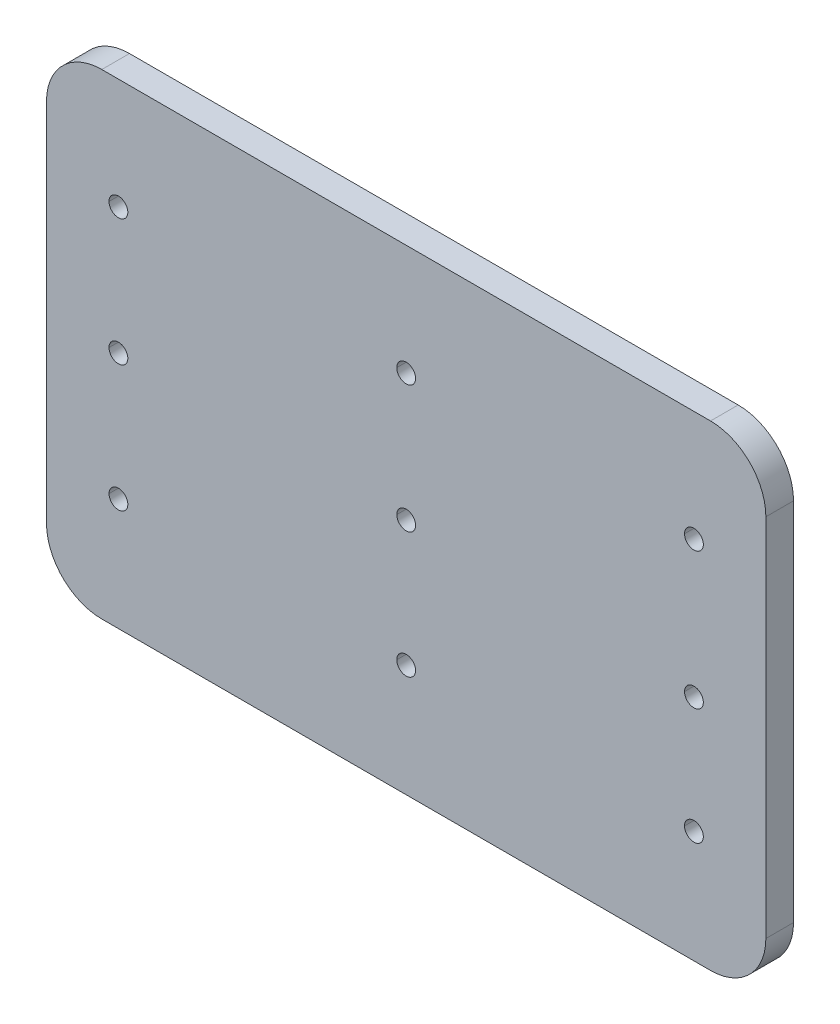
ISO-10303-21;
HEADER;
FILE_DESCRIPTION(('STEP AP214'),'2;1');
FILE_NAME('part.step','',(''),(''),'','','');
FILE_SCHEMA(('AUTOMOTIVE_DESIGN { 1 0 10303 214 1 1 1 1 }'));
ENDSEC;
DATA;
#1=APPLICATION_CONTEXT('core data for automotive mechanical design processes');
#2=APPLICATION_PROTOCOL_DEFINITION('international standard','automotive_design',2000,#1);
#3=PRODUCT_CONTEXT('',#1,'mechanical');
#4=PRODUCT('Part','Part','',(#3));
#5=PRODUCT_RELATED_PRODUCT_CATEGORY('part','',(#4));
#6=PRODUCT_DEFINITION_FORMATION('','',#4);
#7=PRODUCT_DEFINITION_CONTEXT('part definition',#1,'design');
#8=PRODUCT_DEFINITION('design','',#6,#7);
#9=PRODUCT_DEFINITION_SHAPE('','',#8);
#10=(LENGTH_UNIT() NAMED_UNIT(*) SI_UNIT(.MILLI.,.METRE.));
#11=(NAMED_UNIT(*) PLANE_ANGLE_UNIT() SI_UNIT($,.RADIAN.));
#12=(NAMED_UNIT(*) SI_UNIT($,.STERADIAN.) SOLID_ANGLE_UNIT());
#13=UNCERTAINTY_MEASURE_WITH_UNIT(LENGTH_MEASURE(1.E-05),#10,'distance_accuracy_value','');
#14=(GEOMETRIC_REPRESENTATION_CONTEXT(3) GLOBAL_UNCERTAINTY_ASSIGNED_CONTEXT((#13)) GLOBAL_UNIT_ASSIGNED_CONTEXT((#10,
#11,#12)) REPRESENTATION_CONTEXT('',''));
#15=CARTESIAN_POINT('',(0.,0.,0.));
#16=DIRECTION('',(0.,0.,1.));
#17=DIRECTION('',(1.,0.,0.));
#18=AXIS2_PLACEMENT_3D('',#15,#16,#17);
#19=CARTESIAN_POINT('',(116.318744279938,128.56204329235,170.581582908599));
#20=DIRECTION('',(0.,0.,-1.));
#21=DIRECTION('',(-1.,0.,0.));
#22=AXIS2_PLACEMENT_3D('',#19,#20,#21);
#23=CYLINDRICAL_SURFACE('',#22,1.7);
#24=CARTESIAN_POINT('',(116.318744279938,128.56204329235,170.581582908599));
#25=DIRECTION('',(0.,0.,1.));
#26=DIRECTION('',(1.,0.,0.));
#27=AXIS2_PLACEMENT_3D('',#24,#25,#26);
#28=CIRCLE('',#27,1.7);
#29=CARTESIAN_POINT('',(114.618744279938,128.56204329235,170.581582908599));
#30=VERTEX_POINT('',#29);
#31=CARTESIAN_POINT('',(118.018744279938,128.56204329235,170.581582908599));
#32=VERTEX_POINT('',#31);
#33=EDGE_CURVE('E11',#30,#32,#28,.T.);
#34=ORIENTED_EDGE('',*,*,#33,.T.);
#35=DIRECTION('',(0.,0.,-1.));
#36=VECTOR('',#35,1.);
#37=CARTESIAN_POINT('',(118.018744279938,128.56204329235,170.581582908599));
#38=LINE('',#37,#36);
#39=CARTESIAN_POINT('',(118.018744279938,128.56204329235,165.581582908599));
#40=VERTEX_POINT('',#39);
#41=EDGE_CURVE('E55',#32,#40,#38,.T.);
#42=ORIENTED_EDGE('',*,*,#41,.T.);
#43=CARTESIAN_POINT('',(116.318744279938,128.56204329235,165.581582908599));
#44=DIRECTION('',(0.,0.,1.));
#45=DIRECTION('',(1.,0.,0.));
#46=AXIS2_PLACEMENT_3D('',#43,#44,#45);
#47=CIRCLE('',#46,1.7);
#48=CARTESIAN_POINT('',(114.618744279938,128.56204329235,165.581582908599));
#49=VERTEX_POINT('',#48);
#50=EDGE_CURVE('E256',#49,#40,#47,.T.);
#51=ORIENTED_EDGE('',*,*,#50,.F.);
#52=DIRECTION('',(0.,0.,-1.));
#53=VECTOR('',#52,1.);
#54=CARTESIAN_POINT('',(114.618744279938,128.56204329235,170.581582908599));
#55=LINE('',#54,#53);
#56=EDGE_CURVE('E263',#30,#49,#55,.T.);
#57=ORIENTED_EDGE('',*,*,#56,.F.);
#58=EDGE_LOOP('',(#34,#42,#51,#57));
#59=FACE_BOUND('',#58,.T.);
#60=ADVANCED_FACE('F44',(#59),#23,.F.);
#61=CARTESIAN_POINT('',(220.318744279938,103.86204329235,170.581582908599));
#62=DIRECTION('',(0.,0.,-1.));
#63=DIRECTION('',(-1.,0.,0.));
#64=AXIS2_PLACEMENT_3D('',#61,#62,#63);
#65=CYLINDRICAL_SURFACE('',#64,1.7);
#66=CARTESIAN_POINT('',(220.318744279938,103.86204329235,170.581582908599));
#67=DIRECTION('',(0.,0.,1.));
#68=DIRECTION('',(1.,0.,0.));
#69=AXIS2_PLACEMENT_3D('',#66,#67,#68);
#70=CIRCLE('',#69,1.7);
#71=CARTESIAN_POINT('',(218.618744279938,103.86204329235,170.581582908599));
#72=VERTEX_POINT('',#71);
#73=CARTESIAN_POINT('',(222.018744279938,103.86204329235,170.581582908599));
#74=VERTEX_POINT('',#73);
#75=EDGE_CURVE('E322',#72,#74,#70,.T.);
#76=ORIENTED_EDGE('',*,*,#75,.T.);
#77=DIRECTION('',(0.,0.,-1.));
#78=VECTOR('',#77,1.);
#79=CARTESIAN_POINT('',(222.018744279938,103.86204329235,170.581582908599));
#80=LINE('',#79,#78);
#81=CARTESIAN_POINT('',(222.018744279938,103.86204329235,165.581582908599));
#82=VERTEX_POINT('',#81);
#83=EDGE_CURVE('E326',#74,#82,#80,.T.);
#84=ORIENTED_EDGE('',*,*,#83,.T.);
#85=CARTESIAN_POINT('',(220.318744279938,103.86204329235,165.581582908599));
#86=DIRECTION('',(0.,0.,1.));
#87=DIRECTION('',(1.,0.,0.));
#88=AXIS2_PLACEMENT_3D('',#85,#86,#87);
#89=CIRCLE('',#88,1.7);
#90=CARTESIAN_POINT('',(218.618744279938,103.86204329235,165.581582908599));
#91=VERTEX_POINT('',#90);
#92=EDGE_CURVE('E304',#91,#82,#89,.T.);
#93=ORIENTED_EDGE('',*,*,#92,.F.);
#94=DIRECTION('',(0.,0.,-1.));
#95=VECTOR('',#94,1.);
#96=CARTESIAN_POINT('',(218.618744279938,103.86204329235,170.581582908599));
#97=LINE('',#96,#95);
#98=EDGE_CURVE('E371',#72,#91,#97,.T.);
#99=ORIENTED_EDGE('',*,*,#98,.F.);
#100=EDGE_LOOP('',(#76,#84,#93,#99));
#101=FACE_BOUND('',#100,.T.);
#102=ADVANCED_FACE('F593',(#101),#65,.F.);
#103=CARTESIAN_POINT('',(168.318744279938,128.56204329235,170.581582908599));
#104=DIRECTION('',(0.,0.,-1.));
#105=DIRECTION('',(-1.,0.,0.));
#106=AXIS2_PLACEMENT_3D('',#103,#104,#105);
#107=CYLINDRICAL_SURFACE('',#106,1.7);
#108=CARTESIAN_POINT('',(168.318744279938,128.56204329235,170.581582908599));
#109=DIRECTION('',(0.,0.,1.));
#110=DIRECTION('',(1.,0.,0.));
#111=AXIS2_PLACEMENT_3D('',#108,#109,#110);
#112=CIRCLE('',#111,1.7);
#113=CARTESIAN_POINT('',(166.618744279938,128.56204329235,170.581582908599));
#114=VERTEX_POINT('',#113);
#115=CARTESIAN_POINT('',(170.018744279938,128.56204329235,170.581582908599));
#116=VERTEX_POINT('',#115);
#117=EDGE_CURVE('E452',#114,#116,#112,.T.);
#118=ORIENTED_EDGE('',*,*,#117,.T.);
#119=DIRECTION('',(0.,0.,-1.));
#120=VECTOR('',#119,1.);
#121=CARTESIAN_POINT('',(170.018744279938,128.56204329235,170.581582908599));
#122=LINE('',#121,#120);
#123=CARTESIAN_POINT('',(170.018744279938,128.56204329235,165.581582908599));
#124=VERTEX_POINT('',#123);
#125=EDGE_CURVE('E398',#116,#124,#122,.T.);
#126=ORIENTED_EDGE('',*,*,#125,.T.);
#127=CARTESIAN_POINT('',(168.318744279938,128.56204329235,165.581582908599));
#128=DIRECTION('',(0.,0.,1.));
#129=DIRECTION('',(1.,0.,0.));
#130=AXIS2_PLACEMENT_3D('',#127,#128,#129);
#131=CIRCLE('',#130,1.7);
#132=CARTESIAN_POINT('',(166.618744279938,128.56204329235,165.581582908599));
#133=VERTEX_POINT('',#132);
#134=EDGE_CURVE('E479',#133,#124,#131,.T.);
#135=ORIENTED_EDGE('',*,*,#134,.F.);
#136=DIRECTION('',(0.,0.,-1.));
#137=VECTOR('',#136,1.);
#138=CARTESIAN_POINT('',(166.618744279938,128.56204329235,170.581582908599));
#139=LINE('',#138,#137);
#140=EDGE_CURVE('E448',#114,#133,#139,.T.);
#141=ORIENTED_EDGE('',*,*,#140,.F.);
#142=EDGE_LOOP('',(#118,#126,#135,#141));
#143=FACE_BOUND('',#142,.T.);
#144=ADVANCED_FACE('F598',(#143),#107,.F.);
#145=CARTESIAN_POINT('',(168.318744279938,82.84204329235,170.581582908599));
#146=DIRECTION('',(0.,0.,-1.));
#147=DIRECTION('',(-1.,0.,0.));
#148=AXIS2_PLACEMENT_3D('',#145,#146,#147);
#149=CYLINDRICAL_SURFACE('',#148,1.7);
#150=CARTESIAN_POINT('',(168.318744279938,82.84204329235,170.581582908599));
#151=DIRECTION('',(0.,0.,1.));
#152=DIRECTION('',(1.,0.,0.));
#153=AXIS2_PLACEMENT_3D('',#150,#151,#152);
#154=CIRCLE('',#153,1.7);
#155=CARTESIAN_POINT('',(166.618744279938,82.84204329235,170.581582908599));
#156=VERTEX_POINT('',#155);
#157=CARTESIAN_POINT('',(170.018744279938,82.84204329235,170.581582908599));
#158=VERTEX_POINT('',#157);
#159=EDGE_CURVE('E394',#156,#158,#154,.T.);
#160=ORIENTED_EDGE('',*,*,#159,.T.);
#161=DIRECTION('',(0.,0.,-1.));
#162=VECTOR('',#161,1.);
#163=CARTESIAN_POINT('',(170.018744279938,82.84204329235,170.581582908599));
#164=LINE('',#163,#162);
#165=CARTESIAN_POINT('',(170.018744279938,82.84204329235,165.581582908599));
#166=VERTEX_POINT('',#165);
#167=EDGE_CURVE('E399',#158,#166,#164,.T.);
#168=ORIENTED_EDGE('',*,*,#167,.T.);
#169=CARTESIAN_POINT('',(168.318744279938,82.84204329235,165.581582908599));
#170=DIRECTION('',(0.,0.,1.));
#171=DIRECTION('',(1.,0.,0.));
#172=AXIS2_PLACEMENT_3D('',#169,#170,#171);
#173=CIRCLE('',#172,1.7);
#174=CARTESIAN_POINT('',(166.618744279938,82.84204329235,165.581582908599));
#175=VERTEX_POINT('',#174);
#176=EDGE_CURVE('E327',#175,#166,#173,.T.);
#177=ORIENTED_EDGE('',*,*,#176,.F.);
#178=DIRECTION('',(0.,0.,-1.));
#179=VECTOR('',#178,1.);
#180=CARTESIAN_POINT('',(166.618744279938,82.84204329235,170.581582908599));
#181=LINE('',#180,#179);
#182=EDGE_CURVE('E484',#156,#175,#181,.T.);
#183=ORIENTED_EDGE('',*,*,#182,.F.);
#184=EDGE_LOOP('',(#160,#168,#177,#183));
#185=FACE_BOUND('',#184,.T.);
#186=ADVANCED_FACE('F603',(#185),#149,.F.);
#187=CARTESIAN_POINT('',(168.318744279938,105.56204329235,170.581582908599));
#188=DIRECTION('',(0.,0.,-1.));
#189=DIRECTION('',(-1.,0.,0.));
#190=AXIS2_PLACEMENT_3D('',#187,#188,#189);
#191=CYLINDRICAL_SURFACE('',#190,1.7);
#192=CARTESIAN_POINT('',(168.318744279938,105.56204329235,170.581582908599));
#193=DIRECTION('',(0.,0.,1.));
#194=DIRECTION('',(1.,0.,0.));
#195=AXIS2_PLACEMENT_3D('',#192,#193,#194);
#196=CIRCLE('',#195,1.7);
#197=CARTESIAN_POINT('',(166.618744279938,105.56204329235,170.581582908599));
#198=VERTEX_POINT('',#197);
#199=CARTESIAN_POINT('',(170.018744279938,105.56204329235,170.581582908599));
#200=VERTEX_POINT('',#199);
#201=EDGE_CURVE('E340',#198,#200,#196,.T.);
#202=ORIENTED_EDGE('',*,*,#201,.T.);
#203=DIRECTION('',(0.,0.,-1.));
#204=VECTOR('',#203,1.);
#205=CARTESIAN_POINT('',(170.018744279938,105.56204329235,170.581582908599));
#206=LINE('',#205,#204);
#207=CARTESIAN_POINT('',(170.018744279938,105.56204329235,165.581582908599));
#208=VERTEX_POINT('',#207);
#209=EDGE_CURVE('E336',#200,#208,#206,.T.);
#210=ORIENTED_EDGE('',*,*,#209,.T.);
#211=CARTESIAN_POINT('',(168.318744279938,105.56204329235,165.581582908599));
#212=DIRECTION('',(0.,0.,1.));
#213=DIRECTION('',(1.,0.,0.));
#214=AXIS2_PLACEMENT_3D('',#211,#212,#213);
#215=CIRCLE('',#214,1.7);
#216=CARTESIAN_POINT('',(166.618744279938,105.56204329235,165.581582908599));
#217=VERTEX_POINT('',#216);
#218=EDGE_CURVE('E372',#217,#208,#215,.T.);
#219=ORIENTED_EDGE('',*,*,#218,.F.);
#220=DIRECTION('',(0.,0.,-1.));
#221=VECTOR('',#220,1.);
#222=CARTESIAN_POINT('',(166.618744279938,105.56204329235,170.581582908599));
#223=LINE('',#222,#221);
#224=EDGE_CURVE('E459',#198,#217,#223,.T.);
#225=ORIENTED_EDGE('',*,*,#224,.F.);
#226=EDGE_LOOP('',(#202,#210,#219,#225));
#227=FACE_BOUND('',#226,.T.);
#228=ADVANCED_FACE('F743',(#227),#191,.F.);
#229=CARTESIAN_POINT('',(116.318744279938,105.70204329235,170.581582908599));
#230=DIRECTION('',(0.,0.,-1.));
#231=DIRECTION('',(-1.,0.,0.));
#232=AXIS2_PLACEMENT_3D('',#229,#230,#231);
#233=CYLINDRICAL_SURFACE('',#232,1.7);
#234=CARTESIAN_POINT('',(116.318744279938,105.70204329235,170.581582908599));
#235=DIRECTION('',(0.,0.,1.));
#236=DIRECTION('',(1.,0.,0.));
#237=AXIS2_PLACEMENT_3D('',#234,#235,#236);
#238=CIRCLE('',#237,1.7);
#239=CARTESIAN_POINT('',(114.618744279938,105.70204329235,170.581582908599));
#240=VERTEX_POINT('',#239);
#241=CARTESIAN_POINT('',(118.018744279938,105.70204329235,170.581582908599));
#242=VERTEX_POINT('',#241);
#243=EDGE_CURVE('E286',#240,#242,#238,.T.);
#244=ORIENTED_EDGE('',*,*,#243,.T.);
#245=DIRECTION('',(0.,0.,-1.));
#246=VECTOR('',#245,1.);
#247=CARTESIAN_POINT('',(118.018744279938,105.70204329235,170.581582908599));
#248=LINE('',#247,#246);
#249=CARTESIAN_POINT('',(118.018744279938,105.70204329235,165.581582908599));
#250=VERTEX_POINT('',#249);
#251=EDGE_CURVE('E283',#242,#250,#248,.T.);
#252=ORIENTED_EDGE('',*,*,#251,.T.);
#253=CARTESIAN_POINT('',(116.318744279938,105.70204329235,165.581582908599));
#254=DIRECTION('',(0.,0.,1.));
#255=DIRECTION('',(1.,0.,0.));
#256=AXIS2_PLACEMENT_3D('',#253,#254,#255);
#257=CIRCLE('',#256,1.7);
#258=CARTESIAN_POINT('',(114.618744279938,105.70204329235,165.581582908599));
#259=VERTEX_POINT('',#258);
#260=EDGE_CURVE('E271',#259,#250,#257,.T.);
#261=ORIENTED_EDGE('',*,*,#260,.F.);
#262=DIRECTION('',(0.,0.,-1.));
#263=VECTOR('',#262,1.);
#264=CARTESIAN_POINT('',(114.618744279938,105.70204329235,170.581582908599));
#265=LINE('',#264,#263);
#266=EDGE_CURVE('E294',#240,#259,#265,.T.);
#267=ORIENTED_EDGE('',*,*,#266,.F.);
#268=EDGE_LOOP('',(#244,#252,#261,#267));
#269=FACE_BOUND('',#268,.T.);
#270=ADVANCED_FACE('F284',(#269),#233,.F.);
#271=CARTESIAN_POINT('',(220.318744279938,82.84204329235,170.581582908599));
#272=DIRECTION('',(0.,0.,-1.));
#273=DIRECTION('',(-1.,0.,0.));
#274=AXIS2_PLACEMENT_3D('',#271,#272,#273);
#275=CYLINDRICAL_SURFACE('',#274,1.7);
#276=CARTESIAN_POINT('',(220.318744279938,82.84204329235,170.581582908599));
#277=DIRECTION('',(0.,0.,1.));
#278=DIRECTION('',(1.,0.,0.));
#279=AXIS2_PLACEMENT_3D('',#276,#277,#278);
#280=CIRCLE('',#279,1.7);
#281=CARTESIAN_POINT('',(218.618744279938,82.84204329235,170.581582908599));
#282=VERTEX_POINT('',#281);
#283=CARTESIAN_POINT('',(222.018744279938,82.84204329235,170.581582908599));
#284=VERTEX_POINT('',#283);
#285=EDGE_CURVE('E291',#282,#284,#280,.T.);
#286=ORIENTED_EDGE('',*,*,#285,.T.);
#287=DIRECTION('',(0.,0.,-1.));
#288=VECTOR('',#287,1.);
#289=CARTESIAN_POINT('',(222.018744279938,82.84204329235,170.581582908599));
#290=LINE('',#289,#288);
#291=CARTESIAN_POINT('',(222.018744279938,82.84204329235,165.581582908599));
#292=VERTEX_POINT('',#291);
#293=EDGE_CURVE('E432',#284,#292,#290,.T.);
#294=ORIENTED_EDGE('',*,*,#293,.T.);
#295=CARTESIAN_POINT('',(220.318744279938,82.84204329235,165.581582908599));
#296=DIRECTION('',(0.,0.,1.));
#297=DIRECTION('',(1.,0.,0.));
#298=AXIS2_PLACEMENT_3D('',#295,#296,#297);
#299=CIRCLE('',#298,1.7);
#300=CARTESIAN_POINT('',(218.618744279938,82.84204329235,165.581582908599));
#301=VERTEX_POINT('',#300);
#302=EDGE_CURVE('E296',#301,#292,#299,.T.);
#303=ORIENTED_EDGE('',*,*,#302,.F.);
#304=DIRECTION('',(0.,0.,-1.));
#305=VECTOR('',#304,1.);
#306=CARTESIAN_POINT('',(218.618744279938,82.84204329235,170.581582908599));
#307=LINE('',#306,#305);
#308=EDGE_CURVE('E321',#282,#301,#307,.T.);
#309=ORIENTED_EDGE('',*,*,#308,.F.);
#310=EDGE_LOOP('',(#286,#294,#303,#309));
#311=FACE_BOUND('',#310,.T.);
#312=ADVANCED_FACE('F609',(#311),#275,.F.);
#313=CARTESIAN_POINT('',(220.318744279938,128.56204329235,170.581582908599));
#314=DIRECTION('',(0.,0.,-1.));
#315=DIRECTION('',(-1.,0.,0.));
#316=AXIS2_PLACEMENT_3D('',#313,#314,#315);
#317=CYLINDRICAL_SURFACE('',#316,1.7);
#318=CARTESIAN_POINT('',(220.318744279938,128.56204329235,170.581582908599));
#319=DIRECTION('',(0.,0.,1.));
#320=DIRECTION('',(1.,0.,0.));
#321=AXIS2_PLACEMENT_3D('',#318,#319,#320);
#322=CIRCLE('',#321,1.7);
#323=CARTESIAN_POINT('',(218.618744279938,128.56204329235,170.581582908599));
#324=VERTEX_POINT('',#323);
#325=CARTESIAN_POINT('',(222.018744279938,128.56204329235,170.581582908599));
#326=VERTEX_POINT('',#325);
#327=EDGE_CURVE('E428',#324,#326,#322,.T.);
#328=ORIENTED_EDGE('',*,*,#327,.T.);
#329=DIRECTION('',(0.,0.,-1.));
#330=VECTOR('',#329,1.);
#331=CARTESIAN_POINT('',(222.018744279938,128.56204329235,170.581582908599));
#332=LINE('',#331,#330);
#333=CARTESIAN_POINT('',(222.018744279938,128.56204329235,165.581582908599));
#334=VERTEX_POINT('',#333);
#335=EDGE_CURVE('E433',#326,#334,#332,.T.);
#336=ORIENTED_EDGE('',*,*,#335,.T.);
#337=CARTESIAN_POINT('',(220.318744279938,128.56204329235,165.581582908599));
#338=DIRECTION('',(0.,0.,1.));
#339=DIRECTION('',(1.,0.,0.));
#340=AXIS2_PLACEMENT_3D('',#337,#338,#339);
#341=CIRCLE('',#340,1.7);
#342=CARTESIAN_POINT('',(218.618744279938,128.56204329235,165.581582908599));
#343=VERTEX_POINT('',#342);
#344=EDGE_CURVE('E437',#343,#334,#341,.T.);
#345=ORIENTED_EDGE('',*,*,#344,.F.);
#346=DIRECTION('',(0.,0.,-1.));
#347=VECTOR('',#346,1.);
#348=CARTESIAN_POINT('',(218.618744279938,128.56204329235,170.581582908599));
#349=LINE('',#348,#347);
#350=EDGE_CURVE('E307',#324,#343,#349,.T.);
#351=ORIENTED_EDGE('',*,*,#350,.F.);
#352=EDGE_LOOP('',(#328,#336,#345,#351));
#353=FACE_BOUND('',#352,.T.);
#354=ADVANCED_FACE('F607',(#353),#317,.F.);
#355=CARTESIAN_POINT('',(116.318744279938,82.84204329235,170.581582908599));
#356=DIRECTION('',(0.,0.,-1.));
#357=DIRECTION('',(-1.,0.,0.));
#358=AXIS2_PLACEMENT_3D('',#355,#356,#357);
#359=CYLINDRICAL_SURFACE('',#358,1.7);
#360=CARTESIAN_POINT('',(116.318744279938,82.84204329235,170.581582908599));
#361=DIRECTION('',(0.,0.,1.));
#362=DIRECTION('',(1.,0.,0.));
#363=AXIS2_PLACEMENT_3D('',#360,#361,#362);
#364=CIRCLE('',#363,1.7);
#365=CARTESIAN_POINT('',(114.618744279938,82.84204329235,170.581582908599));
#366=VERTEX_POINT('',#365);
#367=CARTESIAN_POINT('',(118.018744279938,82.84204329235,170.581582908599));
#368=VERTEX_POINT('',#367);
#369=EDGE_CURVE('E494',#366,#368,#364,.T.);
#370=ORIENTED_EDGE('',*,*,#369,.T.);
#371=DIRECTION('',(0.,0.,-1.));
#372=VECTOR('',#371,1.);
#373=CARTESIAN_POINT('',(118.018744279938,82.84204329235,170.581582908599));
#374=LINE('',#373,#372);
#375=CARTESIAN_POINT('',(118.018744279938,82.84204329235,165.581582908599));
#376=VERTEX_POINT('',#375);
#377=EDGE_CURVE('E498',#368,#376,#374,.T.);
#378=ORIENTED_EDGE('',*,*,#377,.T.);
#379=CARTESIAN_POINT('',(116.318744279938,82.84204329235,165.581582908599));
#380=DIRECTION('',(0.,0.,1.));
#381=DIRECTION('',(1.,0.,0.));
#382=AXIS2_PLACEMENT_3D('',#379,#380,#381);
#383=CIRCLE('',#382,1.7);
#384=CARTESIAN_POINT('',(114.618744279938,82.84204329235,165.581582908599));
#385=VERTEX_POINT('',#384);
#386=EDGE_CURVE('E351',#385,#376,#383,.T.);
#387=ORIENTED_EDGE('',*,*,#386,.F.);
#388=DIRECTION('',(0.,0.,-1.));
#389=VECTOR('',#388,1.);
#390=CARTESIAN_POINT('',(114.618744279938,82.84204329235,170.581582908599));
#391=LINE('',#390,#389);
#392=EDGE_CURVE('E352',#366,#385,#391,.T.);
#393=ORIENTED_EDGE('',*,*,#392,.F.);
#394=EDGE_LOOP('',(#370,#378,#387,#393));
#395=FACE_BOUND('',#394,.T.);
#396=ADVANCED_FACE('F576',(#395),#359,.F.);
#397=CARTESIAN_POINT('',(113.318744279938,138.56204329235,170.581582908599));
#398=DIRECTION('',(0.,0.,-1.));
#399=DIRECTION('',(-1.,0.,0.));
#400=AXIS2_PLACEMENT_3D('',#397,#398,#399);
#401=CYLINDRICAL_SURFACE('',#400,10.);
#402=CARTESIAN_POINT('',(113.318744279938,138.56204329235,165.581582908599));
#403=DIRECTION('',(0.,0.,-1.));
#404=DIRECTION('',(1.,0.,0.));
#405=AXIS2_PLACEMENT_3D('',#402,#403,#404);
#406=CIRCLE('',#405,10.);
#407=CARTESIAN_POINT('',(103.318744279938,138.56204329235,165.581582908599));
#408=VERTEX_POINT('',#407);
#409=CARTESIAN_POINT('',(113.318744279938,148.56204329235,165.581582908599));
#410=VERTEX_POINT('',#409);
#411=EDGE_CURVE('E48',#408,#410,#406,.T.);
#412=ORIENTED_EDGE('',*,*,#411,.F.);
#413=DIRECTION('',(0.,0.,-1.));
#414=VECTOR('',#413,1.);
#415=CARTESIAN_POINT('',(103.318744279938,138.56204329235,170.581582908599));
#416=LINE('',#415,#414);
#417=CARTESIAN_POINT('',(103.318744279938,138.56204329235,170.581582908599));
#418=VERTEX_POINT('',#417);
#419=EDGE_CURVE('E393',#418,#408,#416,.T.);
#420=ORIENTED_EDGE('',*,*,#419,.F.);
#421=CARTESIAN_POINT('',(113.318744279938,138.56204329235,170.581582908599));
#422=DIRECTION('',(0.,0.,-1.));
#423=DIRECTION('',(1.,0.,0.));
#424=AXIS2_PLACEMENT_3D('',#421,#422,#423);
#425=CIRCLE('',#424,10.);
#426=CARTESIAN_POINT('',(113.318744279938,148.56204329235,170.581582908599));
#427=VERTEX_POINT('',#426);
#428=EDGE_CURVE('E444',#418,#427,#425,.T.);
#429=ORIENTED_EDGE('',*,*,#428,.T.);
#430=DIRECTION('',(0.,0.,-1.));
#431=VECTOR('',#430,1.);
#432=CARTESIAN_POINT('',(113.318744279938,148.56204329235,170.581582908599));
#433=LINE('',#432,#431);
#434=EDGE_CURVE('E392',#427,#410,#433,.T.);
#435=ORIENTED_EDGE('',*,*,#434,.T.);
#436=EDGE_LOOP('',(#412,#420,#429,#435));
#437=FACE_BOUND('',#436,.T.);
#438=ADVANCED_FACE('F659',(#437),#401,.T.);
#439=CARTESIAN_POINT('',(103.318744279938,105.56204329235,170.581582908599));
#440=DIRECTION('',(1.,0.,0.));
#441=DIRECTION('',(0.,1.,0.));
#442=AXIS2_PLACEMENT_3D('',#439,#440,#441);
#443=PLANE('',#442);
#444=DIRECTION('',(0.,-1.,0.));
#445=VECTOR('',#444,1.);
#446=CARTESIAN_POINT('',(103.318744279938,105.56204329235,165.581582908599));
#447=LINE('',#446,#445);
#448=CARTESIAN_POINT('',(103.318744279938,72.5620432923501,165.581582908599));
#449=VERTEX_POINT('',#448);
#450=EDGE_CURVE('E388',#408,#449,#447,.T.);
#451=ORIENTED_EDGE('',*,*,#450,.T.);
#452=DIRECTION('',(0.,0.,-1.));
#453=VECTOR('',#452,1.);
#454=CARTESIAN_POINT('',(103.318744279938,72.5620432923501,170.581582908599));
#455=LINE('',#454,#453);
#456=CARTESIAN_POINT('',(103.318744279938,72.5620432923501,170.581582908599));
#457=VERTEX_POINT('',#456);
#458=EDGE_CURVE('E364',#457,#449,#455,.T.);
#459=ORIENTED_EDGE('',*,*,#458,.F.);
#460=DIRECTION('',(0.,-1.,0.));
#461=VECTOR('',#460,1.);
#462=CARTESIAN_POINT('',(103.318744279938,105.56204329235,170.581582908599));
#463=LINE('',#462,#461);
#464=EDGE_CURVE('E512',#418,#457,#463,.T.);
#465=ORIENTED_EDGE('',*,*,#464,.F.);
#466=ORIENTED_EDGE('',*,*,#419,.T.);
#467=EDGE_LOOP('',(#451,#459,#465,#466));
#468=FACE_BOUND('',#467,.T.);
#469=ADVANCED_FACE('F661',(#468),#443,.F.);
#470=CARTESIAN_POINT('',(113.318744279938,72.56204329235,170.581582908599));
#471=DIRECTION('',(0.,0.,-1.));
#472=DIRECTION('',(-1.,0.,0.));
#473=AXIS2_PLACEMENT_3D('',#470,#471,#472);
#474=CYLINDRICAL_SURFACE('',#473,10.);
#475=CARTESIAN_POINT('',(113.318744279938,72.56204329235,165.581582908599));
#476=DIRECTION('',(0.,0.,-1.));
#477=DIRECTION('',(1.,0.,0.));
#478=AXIS2_PLACEMENT_3D('',#475,#476,#477);
#479=CIRCLE('',#478,10.);
#480=CARTESIAN_POINT('',(113.318744279938,62.56204329235,165.581582908599));
#481=VERTEX_POINT('',#480);
#482=EDGE_CURVE('E313',#481,#449,#479,.T.);
#483=ORIENTED_EDGE('',*,*,#482,.F.);
#484=DIRECTION('',(0.,0.,-1.));
#485=VECTOR('',#484,1.);
#486=CARTESIAN_POINT('',(113.318744279938,62.56204329235,170.581582908599));
#487=LINE('',#486,#485);
#488=CARTESIAN_POINT('',(113.318744279938,62.56204329235,170.581582908599));
#489=VERTEX_POINT('',#488);
#490=EDGE_CURVE('E345',#489,#481,#487,.T.);
#491=ORIENTED_EDGE('',*,*,#490,.F.);
#492=CARTESIAN_POINT('',(113.318744279938,72.56204329235,170.581582908599));
#493=DIRECTION('',(0.,0.,-1.));
#494=DIRECTION('',(1.,0.,0.));
#495=AXIS2_PLACEMENT_3D('',#492,#493,#494);
#496=CIRCLE('',#495,10.);
#497=EDGE_CURVE('E420',#489,#457,#496,.T.);
#498=ORIENTED_EDGE('',*,*,#497,.T.);
#499=ORIENTED_EDGE('',*,*,#458,.T.);
#500=EDGE_LOOP('',(#483,#491,#498,#499));
#501=FACE_BOUND('',#500,.T.);
#502=ADVANCED_FACE('F667',(#501),#474,.T.);
#503=CARTESIAN_POINT('',(168.318744279938,62.56204329235,170.581582908599));
#504=DIRECTION('',(0.,1.,0.));
#505=DIRECTION('',(1.,0.,0.));
#506=AXIS2_PLACEMENT_3D('',#503,#504,#505);
#507=PLANE('',#506);
#508=DIRECTION('',(1.,0.,0.));
#509=VECTOR('',#508,1.);
#510=CARTESIAN_POINT('',(168.318744279938,62.56204329235,165.581582908599));
#511=LINE('',#510,#509);
#512=CARTESIAN_POINT('',(223.318744279938,62.56204329235,165.581582908599));
#513=VERTEX_POINT('',#512);
#514=EDGE_CURVE('E360',#481,#513,#511,.T.);
#515=ORIENTED_EDGE('',*,*,#514,.T.);
#516=DIRECTION('',(0.,0.,-1.));
#517=VECTOR('',#516,1.);
#518=CARTESIAN_POINT('',(223.318744279938,62.56204329235,170.581582908599));
#519=LINE('',#518,#517);
#520=CARTESIAN_POINT('',(223.318744279938,62.56204329235,170.581582908599));
#521=VERTEX_POINT('',#520);
#522=EDGE_CURVE('E346',#521,#513,#519,.T.);
#523=ORIENTED_EDGE('',*,*,#522,.F.);
#524=DIRECTION('',(1.,0.,0.));
#525=VECTOR('',#524,1.);
#526=CARTESIAN_POINT('',(168.318744279938,62.56204329235,170.581582908599));
#527=LINE('',#526,#525);
#528=EDGE_CURVE('E504',#489,#521,#527,.T.);
#529=ORIENTED_EDGE('',*,*,#528,.F.);
#530=ORIENTED_EDGE('',*,*,#490,.T.);
#531=EDGE_LOOP('',(#515,#523,#529,#530));
#532=FACE_BOUND('',#531,.T.);
#533=ADVANCED_FACE('F682',(#532),#507,.F.);
#534=CARTESIAN_POINT('',(223.318744279938,72.56204329235,170.581582908599));
#535=DIRECTION('',(0.,0.,-1.));
#536=DIRECTION('',(-1.,0.,0.));
#537=AXIS2_PLACEMENT_3D('',#534,#535,#536);
#538=CYLINDRICAL_SURFACE('',#537,10.);
#539=CARTESIAN_POINT('',(223.318744279938,72.56204329235,165.581582908599));
#540=DIRECTION('',(0.,0.,1.));
#541=DIRECTION('',(1.,0.,0.));
#542=AXIS2_PLACEMENT_3D('',#539,#540,#541);
#543=CIRCLE('',#542,10.);
#544=CARTESIAN_POINT('',(233.318744279938,72.5620432923501,165.581582908599));
#545=VERTEX_POINT('',#544);
#546=EDGE_CURVE('E341',#513,#545,#543,.T.);
#547=ORIENTED_EDGE('',*,*,#546,.T.);
#548=DIRECTION('',(0.,0.,-1.));
#549=VECTOR('',#548,1.);
#550=CARTESIAN_POINT('',(233.318744279938,72.5620432923501,170.581582908599));
#551=LINE('',#550,#549);
#552=CARTESIAN_POINT('',(233.318744279938,72.5620432923501,170.581582908599));
#553=VERTEX_POINT('',#552);
#554=EDGE_CURVE('E427',#553,#545,#551,.T.);
#555=ORIENTED_EDGE('',*,*,#554,.F.);
#556=CARTESIAN_POINT('',(223.318744279938,72.56204329235,170.581582908599));
#557=DIRECTION('',(0.,0.,1.));
#558=DIRECTION('',(1.,0.,0.));
#559=AXIS2_PLACEMENT_3D('',#556,#557,#558);
#560=CIRCLE('',#559,10.);
#561=EDGE_CURVE('E384',#521,#553,#560,.T.);
#562=ORIENTED_EDGE('',*,*,#561,.F.);
#563=ORIENTED_EDGE('',*,*,#522,.T.);
#564=EDGE_LOOP('',(#547,#555,#562,#563));
#565=FACE_BOUND('',#564,.T.);
#566=ADVANCED_FACE('F684',(#565),#538,.T.);
#567=CARTESIAN_POINT('',(233.318744279938,105.56204329235,170.581582908599));
#568=DIRECTION('',(1.,0.,0.));
#569=DIRECTION('',(0.,1.,0.));
#570=AXIS2_PLACEMENT_3D('',#567,#568,#569);
#571=PLANE('',#570);
#572=DIRECTION('',(0.,-1.,0.));
#573=VECTOR('',#572,1.);
#574=CARTESIAN_POINT('',(233.318744279938,105.56204329235,165.581582908599));
#575=LINE('',#574,#573);
#576=CARTESIAN_POINT('',(233.318744279938,138.56204329235,165.581582908599));
#577=VERTEX_POINT('',#576);
#578=EDGE_CURVE('E317',#577,#545,#575,.T.);
#579=ORIENTED_EDGE('',*,*,#578,.F.);
#580=DIRECTION('',(0.,0.,-1.));
#581=VECTOR('',#580,1.);
#582=CARTESIAN_POINT('',(233.318744279938,138.56204329235,170.581582908599));
#583=LINE('',#582,#581);
#584=CARTESIAN_POINT('',(233.318744279938,138.56204329235,170.581582908599));
#585=VERTEX_POINT('',#584);
#586=EDGE_CURVE('E403',#585,#577,#583,.T.);
#587=ORIENTED_EDGE('',*,*,#586,.F.);
#588=DIRECTION('',(0.,-1.,0.));
#589=VECTOR('',#588,1.);
#590=CARTESIAN_POINT('',(233.318744279938,105.56204329235,170.581582908599));
#591=LINE('',#590,#589);
#592=EDGE_CURVE('E406',#585,#553,#591,.T.);
#593=ORIENTED_EDGE('',*,*,#592,.T.);
#594=ORIENTED_EDGE('',*,*,#554,.T.);
#595=EDGE_LOOP('',(#579,#587,#593,#594));
#596=FACE_BOUND('',#595,.T.);
#597=ADVANCED_FACE('F654',(#596),#571,.T.);
#598=CARTESIAN_POINT('',(223.318744279938,138.56204329235,170.581582908599));
#599=DIRECTION('',(0.,0.,-1.));
#600=DIRECTION('',(-1.,0.,0.));
#601=AXIS2_PLACEMENT_3D('',#598,#599,#600);
#602=CYLINDRICAL_SURFACE('',#601,10.);
#603=CARTESIAN_POINT('',(223.318744279938,138.56204329235,165.581582908599));
#604=DIRECTION('',(0.,0.,1.));
#605=DIRECTION('',(1.,0.,0.));
#606=AXIS2_PLACEMENT_3D('',#603,#604,#605);
#607=CIRCLE('',#606,10.);
#608=CARTESIAN_POINT('',(223.318744279938,148.56204329235,165.581582908599));
#609=VERTEX_POINT('',#608);
#610=EDGE_CURVE('E552',#577,#609,#607,.T.);
#611=ORIENTED_EDGE('',*,*,#610,.T.);
#612=DIRECTION('',(0.,0.,-1.));
#613=VECTOR('',#612,1.);
#614=CARTESIAN_POINT('',(223.318744279938,148.56204329235,170.581582908599));
#615=LINE('',#614,#613);
#616=CARTESIAN_POINT('',(223.318744279938,148.56204329235,170.581582908599));
#617=VERTEX_POINT('',#616);
#618=EDGE_CURVE('E502',#617,#609,#615,.T.);
#619=ORIENTED_EDGE('',*,*,#618,.F.);
#620=CARTESIAN_POINT('',(223.318744279938,138.56204329235,170.581582908599));
#621=DIRECTION('',(0.,0.,1.));
#622=DIRECTION('',(1.,0.,0.));
#623=AXIS2_PLACEMENT_3D('',#620,#621,#622);
#624=CIRCLE('',#623,10.);
#625=EDGE_CURVE('E381',#585,#617,#624,.T.);
#626=ORIENTED_EDGE('',*,*,#625,.F.);
#627=ORIENTED_EDGE('',*,*,#586,.T.);
#628=EDGE_LOOP('',(#611,#619,#626,#627));
#629=FACE_BOUND('',#628,.T.);
#630=ADVANCED_FACE('F649',(#629),#602,.T.);
#631=CARTESIAN_POINT('',(116.318744279938,82.84204329235,170.581582908599));
#632=DIRECTION('',(0.,0.,-1.));
#633=DIRECTION('',(-1.,0.,0.));
#634=AXIS2_PLACEMENT_3D('',#631,#632,#633);
#635=CYLINDRICAL_SURFACE('',#634,1.7);
#636=ORIENTED_EDGE('',*,*,#377,.F.);
#637=CARTESIAN_POINT('',(116.318744279938,82.84204329235,170.581582908599));
#638=DIRECTION('',(0.,0.,1.));
#639=DIRECTION('',(1.,0.,0.));
#640=AXIS2_PLACEMENT_3D('',#637,#638,#639);
#641=CIRCLE('',#640,1.7);
#642=EDGE_CURVE('E356',#368,#366,#641,.T.);
#643=ORIENTED_EDGE('',*,*,#642,.T.);
#644=ORIENTED_EDGE('',*,*,#392,.T.);
#645=CARTESIAN_POINT('',(116.318744279938,82.84204329235,165.581582908599));
#646=DIRECTION('',(0.,0.,1.));
#647=DIRECTION('',(1.,0.,0.));
#648=AXIS2_PLACEMENT_3D('',#645,#646,#647);
#649=CIRCLE('',#648,1.7);
#650=EDGE_CURVE('E347',#376,#385,#649,.T.);
#651=ORIENTED_EDGE('',*,*,#650,.F.);
#652=EDGE_LOOP('',(#636,#643,#644,#651));
#653=FACE_BOUND('',#652,.T.);
#654=ADVANCED_FACE('F580',(#653),#635,.F.);
#655=CARTESIAN_POINT('',(220.318744279938,128.56204329235,170.581582908599));
#656=DIRECTION('',(0.,0.,-1.));
#657=DIRECTION('',(-1.,0.,0.));
#658=AXIS2_PLACEMENT_3D('',#655,#656,#657);
#659=CYLINDRICAL_SURFACE('',#658,1.7);
#660=ORIENTED_EDGE('',*,*,#335,.F.);
#661=CARTESIAN_POINT('',(220.318744279938,128.56204329235,170.581582908599));
#662=DIRECTION('',(0.,0.,1.));
#663=DIRECTION('',(1.,0.,0.));
#664=AXIS2_PLACEMENT_3D('',#661,#662,#663);
#665=CIRCLE('',#664,1.7);
#666=EDGE_CURVE('E311',#326,#324,#665,.T.);
#667=ORIENTED_EDGE('',*,*,#666,.T.);
#668=ORIENTED_EDGE('',*,*,#350,.T.);
#669=CARTESIAN_POINT('',(220.318744279938,128.56204329235,165.581582908599));
#670=DIRECTION('',(0.,0.,1.));
#671=DIRECTION('',(1.,0.,0.));
#672=AXIS2_PLACEMENT_3D('',#669,#670,#671);
#673=CIRCLE('',#672,1.7);
#674=EDGE_CURVE('E485',#334,#343,#673,.T.);
#675=ORIENTED_EDGE('',*,*,#674,.F.);
#676=EDGE_LOOP('',(#660,#667,#668,#675));
#677=FACE_BOUND('',#676,.T.);
#678=ADVANCED_FACE('F639',(#677),#659,.F.);
#679=CARTESIAN_POINT('',(220.318744279938,82.84204329235,170.581582908599));
#680=DIRECTION('',(0.,0.,-1.));
#681=DIRECTION('',(-1.,0.,0.));
#682=AXIS2_PLACEMENT_3D('',#679,#680,#681);
#683=CYLINDRICAL_SURFACE('',#682,1.7);
#684=ORIENTED_EDGE('',*,*,#293,.F.);
#685=CARTESIAN_POINT('',(220.318744279938,82.84204329235,170.581582908599));
#686=DIRECTION('',(0.,0.,1.));
#687=DIRECTION('',(1.,0.,0.));
#688=AXIS2_PLACEMENT_3D('',#685,#686,#687);
#689=CIRCLE('',#688,1.7);
#690=EDGE_CURVE('E312',#284,#282,#689,.T.);
#691=ORIENTED_EDGE('',*,*,#690,.T.);
#692=ORIENTED_EDGE('',*,*,#308,.T.);
#693=CARTESIAN_POINT('',(220.318744279938,82.84204329235,165.581582908599));
#694=DIRECTION('',(0.,0.,1.));
#695=DIRECTION('',(1.,0.,0.));
#696=AXIS2_PLACEMENT_3D('',#693,#694,#695);
#697=CIRCLE('',#696,1.7);
#698=EDGE_CURVE('E301',#292,#301,#697,.T.);
#699=ORIENTED_EDGE('',*,*,#698,.F.);
#700=EDGE_LOOP('',(#684,#691,#692,#699));
#701=FACE_BOUND('',#700,.T.);
#702=ADVANCED_FACE('F643',(#701),#683,.F.);
#703=CARTESIAN_POINT('',(116.318744279938,105.70204329235,170.581582908599));
#704=DIRECTION('',(0.,0.,-1.));
#705=DIRECTION('',(-1.,0.,0.));
#706=AXIS2_PLACEMENT_3D('',#703,#704,#705);
#707=CYLINDRICAL_SURFACE('',#706,1.7);
#708=ORIENTED_EDGE('',*,*,#251,.F.);
#709=CARTESIAN_POINT('',(116.318744279938,105.70204329235,170.581582908599));
#710=DIRECTION('',(0.,0.,1.));
#711=DIRECTION('',(1.,0.,0.));
#712=AXIS2_PLACEMENT_3D('',#709,#710,#711);
#713=CIRCLE('',#712,1.7);
#714=EDGE_CURVE('E357',#242,#240,#713,.T.);
#715=ORIENTED_EDGE('',*,*,#714,.T.);
#716=ORIENTED_EDGE('',*,*,#266,.T.);
#717=CARTESIAN_POINT('',(116.318744279938,105.70204329235,165.581582908599));
#718=DIRECTION('',(0.,0.,1.));
#719=DIRECTION('',(1.,0.,0.));
#720=AXIS2_PLACEMENT_3D('',#717,#718,#719);
#721=CIRCLE('',#720,1.7);
#722=EDGE_CURVE('E276',#250,#259,#721,.T.);
#723=ORIENTED_EDGE('',*,*,#722,.F.);
#724=EDGE_LOOP('',(#708,#715,#716,#723));
#725=FACE_BOUND('',#724,.T.);
#726=ADVANCED_FACE('F293',(#725),#707,.F.);
#727=CARTESIAN_POINT('',(168.318744279938,105.56204329235,170.581582908599));
#728=DIRECTION('',(0.,0.,-1.));
#729=DIRECTION('',(-1.,0.,0.));
#730=AXIS2_PLACEMENT_3D('',#727,#728,#729);
#731=CYLINDRICAL_SURFACE('',#730,1.7);
#732=ORIENTED_EDGE('',*,*,#209,.F.);
#733=CARTESIAN_POINT('',(168.318744279938,105.56204329235,170.581582908599));
#734=DIRECTION('',(0.,0.,1.));
#735=DIRECTION('',(1.,0.,0.));
#736=AXIS2_PLACEMENT_3D('',#733,#734,#735);
#737=CIRCLE('',#736,1.7);
#738=EDGE_CURVE('E440',#200,#198,#737,.T.);
#739=ORIENTED_EDGE('',*,*,#738,.T.);
#740=ORIENTED_EDGE('',*,*,#224,.T.);
#741=CARTESIAN_POINT('',(168.318744279938,105.56204329235,165.581582908599));
#742=DIRECTION('',(0.,0.,1.));
#743=DIRECTION('',(1.,0.,0.));
#744=AXIS2_PLACEMENT_3D('',#741,#742,#743);
#745=CIRCLE('',#744,1.7);
#746=EDGE_CURVE('E280',#208,#217,#745,.T.);
#747=ORIENTED_EDGE('',*,*,#746,.F.);
#748=EDGE_LOOP('',(#732,#739,#740,#747));
#749=FACE_BOUND('',#748,.T.);
#750=ADVANCED_FACE('F614',(#749),#731,.F.);
#751=CARTESIAN_POINT('',(168.318744279938,82.84204329235,170.581582908599));
#752=DIRECTION('',(0.,0.,-1.));
#753=DIRECTION('',(-1.,0.,0.));
#754=AXIS2_PLACEMENT_3D('',#751,#752,#753);
#755=CYLINDRICAL_SURFACE('',#754,1.7);
#756=ORIENTED_EDGE('',*,*,#167,.F.);
#757=CARTESIAN_POINT('',(168.318744279938,82.84204329235,170.581582908599));
#758=DIRECTION('',(0.,0.,1.));
#759=DIRECTION('',(1.,0.,0.));
#760=AXIS2_PLACEMENT_3D('',#757,#758,#759);
#761=CIRCLE('',#760,1.7);
#762=EDGE_CURVE('E463',#158,#156,#761,.T.);
#763=ORIENTED_EDGE('',*,*,#762,.T.);
#764=ORIENTED_EDGE('',*,*,#182,.T.);
#765=CARTESIAN_POINT('',(168.318744279938,82.84204329235,165.581582908599));
#766=DIRECTION('',(0.,0.,1.));
#767=DIRECTION('',(1.,0.,0.));
#768=AXIS2_PLACEMENT_3D('',#765,#766,#767);
#769=CIRCLE('',#768,1.7);
#770=EDGE_CURVE('E331',#166,#175,#769,.T.);
#771=ORIENTED_EDGE('',*,*,#770,.F.);
#772=EDGE_LOOP('',(#756,#763,#764,#771));
#773=FACE_BOUND('',#772,.T.);
#774=ADVANCED_FACE('F611',(#773),#755,.F.);
#775=CARTESIAN_POINT('',(168.318744279938,128.56204329235,170.581582908599));
#776=DIRECTION('',(0.,0.,-1.));
#777=DIRECTION('',(-1.,0.,0.));
#778=AXIS2_PLACEMENT_3D('',#775,#776,#777);
#779=CYLINDRICAL_SURFACE('',#778,1.7);
#780=ORIENTED_EDGE('',*,*,#125,.F.);
#781=CARTESIAN_POINT('',(168.318744279938,128.56204329235,170.581582908599));
#782=DIRECTION('',(0.,0.,1.));
#783=DIRECTION('',(1.,0.,0.));
#784=AXIS2_PLACEMENT_3D('',#781,#782,#783);
#785=CIRCLE('',#784,1.7);
#786=EDGE_CURVE('E480',#116,#114,#785,.T.);
#787=ORIENTED_EDGE('',*,*,#786,.T.);
#788=ORIENTED_EDGE('',*,*,#140,.T.);
#789=CARTESIAN_POINT('',(168.318744279938,128.56204329235,165.581582908599));
#790=DIRECTION('',(0.,0.,1.));
#791=DIRECTION('',(1.,0.,0.));
#792=AXIS2_PLACEMENT_3D('',#789,#790,#791);
#793=CIRCLE('',#792,1.7);
#794=EDGE_CURVE('E330',#124,#133,#793,.T.);
#795=ORIENTED_EDGE('',*,*,#794,.F.);
#796=EDGE_LOOP('',(#780,#787,#788,#795));
#797=FACE_BOUND('',#796,.T.);
#798=ADVANCED_FACE('F613',(#797),#779,.F.);
#799=CARTESIAN_POINT('',(220.318744279938,103.86204329235,170.581582908599));
#800=DIRECTION('',(0.,0.,-1.));
#801=DIRECTION('',(-1.,0.,0.));
#802=AXIS2_PLACEMENT_3D('',#799,#800,#801);
#803=CYLINDRICAL_SURFACE('',#802,1.7);
#804=ORIENTED_EDGE('',*,*,#83,.F.);
#805=CARTESIAN_POINT('',(220.318744279938,103.86204329235,170.581582908599));
#806=DIRECTION('',(0.,0.,1.));
#807=DIRECTION('',(1.,0.,0.));
#808=AXIS2_PLACEMENT_3D('',#805,#806,#807);
#809=CIRCLE('',#808,1.7);
#810=EDGE_CURVE('E416',#74,#72,#809,.T.);
#811=ORIENTED_EDGE('',*,*,#810,.T.);
#812=ORIENTED_EDGE('',*,*,#98,.T.);
#813=CARTESIAN_POINT('',(220.318744279938,103.86204329235,165.581582908599));
#814=DIRECTION('',(0.,0.,1.));
#815=DIRECTION('',(1.,0.,0.));
#816=AXIS2_PLACEMENT_3D('',#813,#814,#815);
#817=CIRCLE('',#816,1.7);
#818=EDGE_CURVE('E475',#82,#91,#817,.T.);
#819=ORIENTED_EDGE('',*,*,#818,.F.);
#820=EDGE_LOOP('',(#804,#811,#812,#819));
#821=FACE_BOUND('',#820,.T.);
#822=ADVANCED_FACE('F619',(#821),#803,.F.);
#823=CARTESIAN_POINT('',(116.318744279938,128.56204329235,170.581582908599));
#824=DIRECTION('',(0.,0.,-1.));
#825=DIRECTION('',(-1.,0.,0.));
#826=AXIS2_PLACEMENT_3D('',#823,#824,#825);
#827=CYLINDRICAL_SURFACE('',#826,1.7);
#828=ORIENTED_EDGE('',*,*,#41,.F.);
#829=CARTESIAN_POINT('',(116.318744279938,128.56204329235,170.581582908599));
#830=DIRECTION('',(0.,0.,1.));
#831=DIRECTION('',(1.,0.,0.));
#832=AXIS2_PLACEMENT_3D('',#829,#830,#831);
#833=CIRCLE('',#832,1.7);
#834=EDGE_CURVE('E368',#32,#30,#833,.T.);
#835=ORIENTED_EDGE('',*,*,#834,.T.);
#836=ORIENTED_EDGE('',*,*,#56,.T.);
#837=CARTESIAN_POINT('',(116.318744279938,128.56204329235,165.581582908599));
#838=DIRECTION('',(0.,0.,1.));
#839=DIRECTION('',(1.,0.,0.));
#840=AXIS2_PLACEMENT_3D('',#837,#838,#839);
#841=CIRCLE('',#840,1.7);
#842=EDGE_CURVE('E377',#40,#49,#841,.T.);
#843=ORIENTED_EDGE('',*,*,#842,.F.);
#844=EDGE_LOOP('',(#828,#835,#836,#843));
#845=FACE_BOUND('',#844,.T.);
#846=ADVANCED_FACE('F815',(#845),#827,.F.);
#847=CARTESIAN_POINT('',(168.318744279938,148.56204329235,170.581582908599));
#848=DIRECTION('',(0.,1.,0.));
#849=DIRECTION('',(1.,0.,0.));
#850=AXIS2_PLACEMENT_3D('',#847,#848,#849);
#851=PLANE('',#850);
#852=DIRECTION('',(1.,0.,0.));
#853=VECTOR('',#852,1.);
#854=CARTESIAN_POINT('',(168.318744279938,148.56204329235,165.581582908599));
#855=LINE('',#854,#853);
#856=EDGE_CURVE('E332',#410,#609,#855,.T.);
#857=ORIENTED_EDGE('',*,*,#856,.F.);
#858=ORIENTED_EDGE('',*,*,#434,.F.);
#859=DIRECTION('',(1.,0.,0.));
#860=VECTOR('',#859,1.);
#861=CARTESIAN_POINT('',(168.318744279938,148.56204329235,170.581582908599));
#862=LINE('',#861,#860);
#863=EDGE_CURVE('E499',#427,#617,#862,.T.);
#864=ORIENTED_EDGE('',*,*,#863,.T.);
#865=ORIENTED_EDGE('',*,*,#618,.T.);
#866=EDGE_LOOP('',(#857,#858,#864,#865));
#867=FACE_BOUND('',#866,.T.);
#868=ADVANCED_FACE('F588',(#867),#851,.T.);
#869=CARTESIAN_POINT('',(168.318744279938,105.56204329235,170.581582908599));
#870=DIRECTION('',(0.,0.,1.));
#871=DIRECTION('',(1.,0.,0.));
#872=AXIS2_PLACEMENT_3D('',#869,#870,#871);
#873=PLANE('',#872);
#874=ORIENTED_EDGE('',*,*,#428,.F.);
#875=ORIENTED_EDGE('',*,*,#464,.T.);
#876=ORIENTED_EDGE('',*,*,#497,.F.);
#877=ORIENTED_EDGE('',*,*,#528,.T.);
#878=ORIENTED_EDGE('',*,*,#561,.T.);
#879=ORIENTED_EDGE('',*,*,#592,.F.);
#880=ORIENTED_EDGE('',*,*,#625,.T.);
#881=ORIENTED_EDGE('',*,*,#863,.F.);
#882=EDGE_LOOP('',(#874,#875,#876,#877,#878,#879,#880,#881));
#883=FACE_BOUND('',#882,.T.);
#884=ORIENTED_EDGE('',*,*,#33,.F.);
#885=ORIENTED_EDGE('',*,*,#834,.F.);
#886=EDGE_LOOP('',(#884,#885));
#887=FACE_BOUND('',#886,.T.);
#888=ORIENTED_EDGE('',*,*,#75,.F.);
#889=ORIENTED_EDGE('',*,*,#810,.F.);
#890=EDGE_LOOP('',(#888,#889));
#891=FACE_BOUND('',#890,.T.);
#892=ORIENTED_EDGE('',*,*,#117,.F.);
#893=ORIENTED_EDGE('',*,*,#786,.F.);
#894=EDGE_LOOP('',(#892,#893));
#895=FACE_BOUND('',#894,.T.);
#896=ORIENTED_EDGE('',*,*,#159,.F.);
#897=ORIENTED_EDGE('',*,*,#762,.F.);
#898=EDGE_LOOP('',(#896,#897));
#899=FACE_BOUND('',#898,.T.);
#900=ORIENTED_EDGE('',*,*,#201,.F.);
#901=ORIENTED_EDGE('',*,*,#738,.F.);
#902=EDGE_LOOP('',(#900,#901));
#903=FACE_BOUND('',#902,.T.);
#904=ORIENTED_EDGE('',*,*,#243,.F.);
#905=ORIENTED_EDGE('',*,*,#714,.F.);
#906=EDGE_LOOP('',(#904,#905));
#907=FACE_BOUND('',#906,.T.);
#908=ORIENTED_EDGE('',*,*,#285,.F.);
#909=ORIENTED_EDGE('',*,*,#690,.F.);
#910=EDGE_LOOP('',(#908,#909));
#911=FACE_BOUND('',#910,.T.);
#912=ORIENTED_EDGE('',*,*,#327,.F.);
#913=ORIENTED_EDGE('',*,*,#666,.F.);
#914=EDGE_LOOP('',(#912,#913));
#915=FACE_BOUND('',#914,.T.);
#916=ORIENTED_EDGE('',*,*,#369,.F.);
#917=ORIENTED_EDGE('',*,*,#642,.F.);
#918=EDGE_LOOP('',(#916,#917));
#919=FACE_BOUND('',#918,.T.);
#920=ADVANCED_FACE('F46',(#883,#887,#891,#895,#899,#903,#907,#911,#915,#919),#873,.T.);
#921=CARTESIAN_POINT('',(168.318744279938,105.56204329235,165.581582908599));
#922=DIRECTION('',(0.,0.,1.));
#923=DIRECTION('',(1.,0.,0.));
#924=AXIS2_PLACEMENT_3D('',#921,#922,#923);
#925=PLANE('',#924);
#926=ORIENTED_EDGE('',*,*,#411,.T.);
#927=ORIENTED_EDGE('',*,*,#856,.T.);
#928=ORIENTED_EDGE('',*,*,#610,.F.);
#929=ORIENTED_EDGE('',*,*,#578,.T.);
#930=ORIENTED_EDGE('',*,*,#546,.F.);
#931=ORIENTED_EDGE('',*,*,#514,.F.);
#932=ORIENTED_EDGE('',*,*,#482,.T.);
#933=ORIENTED_EDGE('',*,*,#450,.F.);
#934=EDGE_LOOP('',(#926,#927,#928,#929,#930,#931,#932,#933));
#935=FACE_BOUND('',#934,.T.);
#936=ORIENTED_EDGE('',*,*,#50,.T.);
#937=ORIENTED_EDGE('',*,*,#842,.T.);
#938=EDGE_LOOP('',(#936,#937));
#939=FACE_BOUND('',#938,.T.);
#940=ORIENTED_EDGE('',*,*,#92,.T.);
#941=ORIENTED_EDGE('',*,*,#818,.T.);
#942=EDGE_LOOP('',(#940,#941));
#943=FACE_BOUND('',#942,.T.);
#944=ORIENTED_EDGE('',*,*,#134,.T.);
#945=ORIENTED_EDGE('',*,*,#794,.T.);
#946=EDGE_LOOP('',(#944,#945));
#947=FACE_BOUND('',#946,.T.);
#948=ORIENTED_EDGE('',*,*,#176,.T.);
#949=ORIENTED_EDGE('',*,*,#770,.T.);
#950=EDGE_LOOP('',(#948,#949));
#951=FACE_BOUND('',#950,.T.);
#952=ORIENTED_EDGE('',*,*,#218,.T.);
#953=ORIENTED_EDGE('',*,*,#746,.T.);
#954=EDGE_LOOP('',(#952,#953));
#955=FACE_BOUND('',#954,.T.);
#956=ORIENTED_EDGE('',*,*,#260,.T.);
#957=ORIENTED_EDGE('',*,*,#722,.T.);
#958=EDGE_LOOP('',(#956,#957));
#959=FACE_BOUND('',#958,.T.);
#960=ORIENTED_EDGE('',*,*,#302,.T.);
#961=ORIENTED_EDGE('',*,*,#698,.T.);
#962=EDGE_LOOP('',(#960,#961));
#963=FACE_BOUND('',#962,.T.);
#964=ORIENTED_EDGE('',*,*,#344,.T.);
#965=ORIENTED_EDGE('',*,*,#674,.T.);
#966=EDGE_LOOP('',(#964,#965));
#967=FACE_BOUND('',#966,.T.);
#968=ORIENTED_EDGE('',*,*,#386,.T.);
#969=ORIENTED_EDGE('',*,*,#650,.T.);
#970=EDGE_LOOP('',(#968,#969));
#971=FACE_BOUND('',#970,.T.);
#972=ADVANCED_FACE('F273',(#935,#939,#943,#947,#951,#955,#959,#963,#967,#971),#925,.F.);
#973=CLOSED_SHELL('',(#60,#102,#144,#186,#228,#270,#312,#354,#396,#438,#469,#502,#533,#566,#597,
#630,#654,#678,#702,#726,#750,#774,#798,#822,#846,#868,#920,#972));
#974=MANIFOLD_SOLID_BREP('B2',#973);
#975=ADVANCED_BREP_SHAPE_REPRESENTATION('',(#18,#974),#14);
#976=SHAPE_DEFINITION_REPRESENTATION(#9,#975);
ENDSEC;
END-ISO-10303-21;
